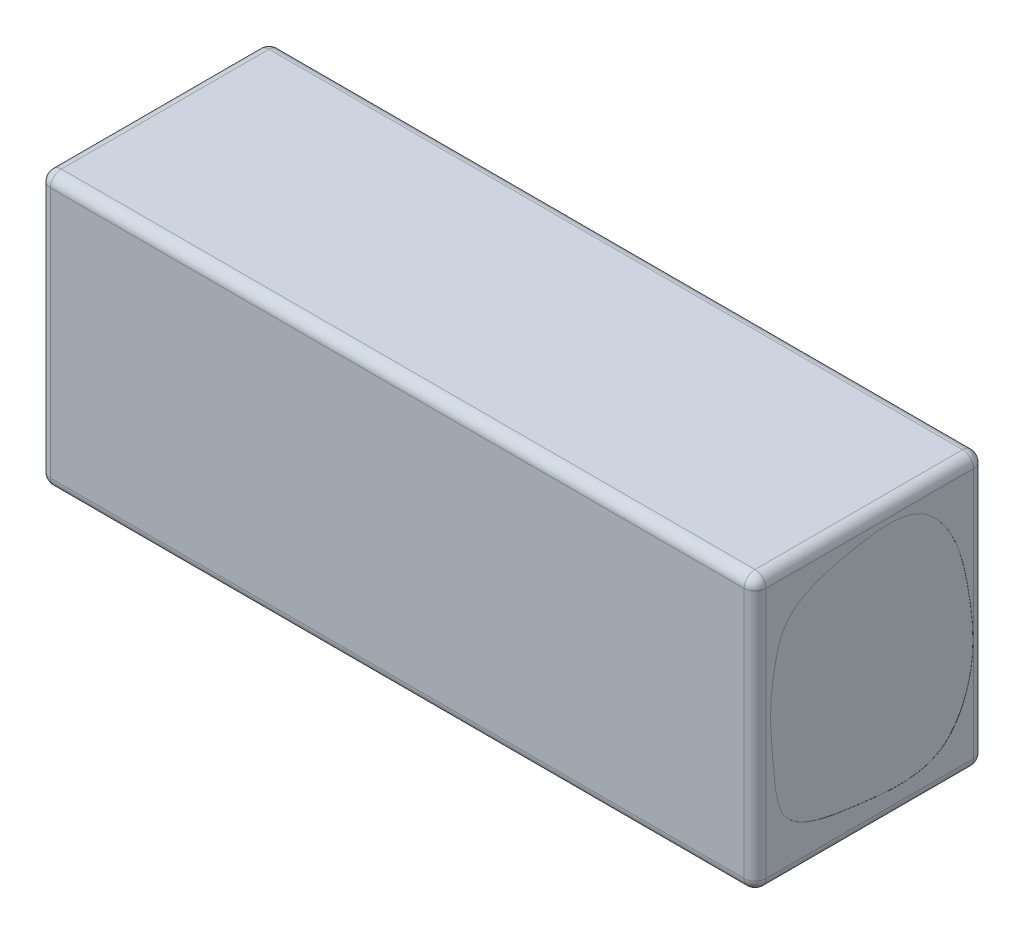
ISO-10303-21;
HEADER;
FILE_DESCRIPTION(('STEP AP214'),'2;1');
FILE_NAME('part.step','',(''),(''),'','','');
FILE_SCHEMA(('AUTOMOTIVE_DESIGN { 1 0 10303 214 1 1 1 1 }'));
ENDSEC;
DATA;
#1=APPLICATION_CONTEXT('core data for automotive mechanical design processes');
#2=APPLICATION_PROTOCOL_DEFINITION('international standard','automotive_design',2000,#1);
#3=PRODUCT_CONTEXT('',#1,'mechanical');
#4=PRODUCT('Part','Part','',(#3));
#5=PRODUCT_RELATED_PRODUCT_CATEGORY('part','',(#4));
#6=PRODUCT_DEFINITION_FORMATION('','',#4);
#7=PRODUCT_DEFINITION_CONTEXT('part definition',#1,'design');
#8=PRODUCT_DEFINITION('design','',#6,#7);
#9=PRODUCT_DEFINITION_SHAPE('','',#8);
#10=(LENGTH_UNIT() NAMED_UNIT(*) SI_UNIT(.MILLI.,.METRE.));
#11=(NAMED_UNIT(*) PLANE_ANGLE_UNIT() SI_UNIT($,.RADIAN.));
#12=(NAMED_UNIT(*) SI_UNIT($,.STERADIAN.) SOLID_ANGLE_UNIT());
#13=UNCERTAINTY_MEASURE_WITH_UNIT(LENGTH_MEASURE(1.E-05),#10,'distance_accuracy_value','');
#14=(GEOMETRIC_REPRESENTATION_CONTEXT(3) GLOBAL_UNCERTAINTY_ASSIGNED_CONTEXT((#13)) GLOBAL_UNIT_ASSIGNED_CONTEXT((#10,
#11,#12)) REPRESENTATION_CONTEXT('',''));
#15=CARTESIAN_POINT('',(0.,0.,0.));
#16=DIRECTION('',(0.,0.,1.));
#17=DIRECTION('',(1.,0.,0.));
#18=AXIS2_PLACEMENT_3D('',#15,#16,#17);
#19=CARTESIAN_POINT('',(65.5,50.,-21.));
#20=DIRECTION('',(-1.,0.,0.));
#21=DIRECTION('',(0.,0.,1.));
#22=AXIS2_PLACEMENT_3D('',#19,#20,#21);
#23=PLANE('',#22);
#24=DIRECTION('',(0.,0.,-1.));
#25=VECTOR('',#24,1.);
#26=CARTESIAN_POINT('',(65.5,48.,21.));
#27=LINE('',#26,#25);
#28=CARTESIAN_POINT('',(65.5,48.,-19.));
#29=VERTEX_POINT('',#28);
#30=CARTESIAN_POINT('',(65.5,48.,19.));
#31=VERTEX_POINT('',#30);
#32=EDGE_CURVE('E266',#29,#31,#27,.F.);
#33=ORIENTED_EDGE('',*,*,#32,.T.);
#34=DIRECTION('',(0.,-1.,0.));
#35=VECTOR('',#34,1.);
#36=CARTESIAN_POINT('',(65.5,50.,19.));
#37=LINE('',#36,#35);
#38=CARTESIAN_POINT('',(65.5,2.,19.));
#39=VERTEX_POINT('',#38);
#40=EDGE_CURVE('E11',#31,#39,#37,.T.);
#41=ORIENTED_EDGE('',*,*,#40,.T.);
#42=DIRECTION('',(0.,0.,-1.));
#43=VECTOR('',#42,1.);
#44=CARTESIAN_POINT('',(65.5,2.,-21.));
#45=LINE('',#44,#43);
#46=CARTESIAN_POINT('',(65.5,2.,-19.));
#47=VERTEX_POINT('',#46);
#48=EDGE_CURVE('E49',#39,#47,#45,.T.);
#49=ORIENTED_EDGE('',*,*,#48,.T.);
#50=DIRECTION('',(0.,-1.,0.));
#51=VECTOR('',#50,1.);
#52=CARTESIAN_POINT('',(65.5,50.,-19.));
#53=LINE('',#52,#51);
#54=EDGE_CURVE('E268',#47,#29,#53,.F.);
#55=ORIENTED_EDGE('',*,*,#54,.T.);
#56=EDGE_LOOP('',(#33,#41,#49,#55));
#57=FACE_BOUND('',#56,.T.);
#58=CARTESIAN_POINT('',(65.5,36.0062960021772,17.1121145566678));
#59=CARTESIAN_POINT('',(65.5,33.1858424415359,17.7934548720197));
#60=CARTESIAN_POINT('',(65.5,27.1956559210834,18.5188642546495));
#61=CARTESIAN_POINT('',(65.5,18.8029734796803,17.5432714824491));
#62=CARTESIAN_POINT('',(65.5,7.47670080643906,16.6669742288101));
#63=CARTESIAN_POINT('',(65.5,5.7999690782184,6.44101406092995));
#64=CARTESIAN_POINT('',(65.5,4.62237682686579,-3.03846388193815));
#65=CARTESIAN_POINT('',(65.5,3.8415159513343,-13.2611809845686));
#66=CARTESIAN_POINT('',(65.5,16.1684517078521,-19.7797162965153));
#67=CARTESIAN_POINT('',(65.5,27.9396396582075,-18.5050263082708));
#68=CARTESIAN_POINT('',(65.5,38.8581884667947,-16.1620227417595));
#69=CARTESIAN_POINT('',(65.5,48.1548398260885,-8.67976880806955));
#70=CARTESIAN_POINT('',(65.5,46.3624852692565,3.85963842153659));
#71=CARTESIAN_POINT('',(65.5,43.0888660648263,15.057082787652));
#72=CARTESIAN_POINT('',(65.5,37.4230165702435,16.7698756869761));
#73=CARTESIAN_POINT('',(65.5,36.0062960021772,17.1121145566678));
#74=B_SPLINE_CURVE_WITH_KNOTS('',3,(#58,#59,#60,#61,#62,#63,#64,#65,#66,#67,#68,#69,#70,#71,#72,
#73),.UNSPECIFIED.,.T.,.F.,(4,1,1,1,1,1,1,1,1,1,1,1,1,4),(0.,0.0655264461558585,
0.138836815268561,0.200734432776751,0.302156424209846,0.328629371683951,0.429788646280039,
0.502846282513567,0.615006546447287,0.699860715547892,0.760876953691549,0.868209931019146,
0.967085909402392,1.),.UNSPECIFIED.);
#75=CARTESIAN_POINT('',(65.5,36.0062960021772,17.1121145566678));
#76=VERTEX_POINT('',#75);
#77=EDGE_CURVE('E209',#76,#76,#74,.T.);
#78=ORIENTED_EDGE('',*,*,#77,.F.);
#79=EDGE_LOOP('',(#78));
#80=FACE_BOUND('',#79,.T.);
#81=ADVANCED_FACE('F40',(#57,#80),#23,.F.);
#82=CARTESIAN_POINT('',(-65.5,50.,-21.));
#83=DIRECTION('',(0.,0.,1.));
#84=DIRECTION('',(1.,0.,0.));
#85=AXIS2_PLACEMENT_3D('',#82,#83,#84);
#86=PLANE('',#85);
#87=DIRECTION('',(-1.,0.,0.));
#88=VECTOR('',#87,1.);
#89=CARTESIAN_POINT('',(-65.5,2.,-21.));
#90=LINE('',#89,#88);
#91=CARTESIAN_POINT('',(63.5,2.,-21.));
#92=VERTEX_POINT('',#91);
#93=CARTESIAN_POINT('',(-63.5,2.,-21.));
#94=VERTEX_POINT('',#93);
#95=EDGE_CURVE('E236',#92,#94,#90,.T.);
#96=ORIENTED_EDGE('',*,*,#95,.T.);
#97=DIRECTION('',(0.,-1.,0.));
#98=VECTOR('',#97,1.);
#99=CARTESIAN_POINT('',(-63.5,50.,-21.));
#100=LINE('',#99,#98);
#101=CARTESIAN_POINT('',(-63.5,48.,-21.));
#102=VERTEX_POINT('',#101);
#103=EDGE_CURVE('E238',#94,#102,#100,.F.);
#104=ORIENTED_EDGE('',*,*,#103,.T.);
#105=DIRECTION('',(-1.,0.,0.));
#106=VECTOR('',#105,1.);
#107=CARTESIAN_POINT('',(65.5,48.,-21.));
#108=LINE('',#107,#106);
#109=CARTESIAN_POINT('',(63.5,48.,-21.));
#110=VERTEX_POINT('',#109);
#111=EDGE_CURVE('E232',#102,#110,#108,.F.);
#112=ORIENTED_EDGE('',*,*,#111,.T.);
#113=DIRECTION('',(0.,-1.,0.));
#114=VECTOR('',#113,1.);
#115=CARTESIAN_POINT('',(63.5,50.,-21.));
#116=LINE('',#115,#114);
#117=EDGE_CURVE('E234',#110,#92,#116,.T.);
#118=ORIENTED_EDGE('',*,*,#117,.T.);
#119=EDGE_LOOP('',(#96,#104,#112,#118));
#120=FACE_BOUND('',#119,.T.);
#121=ADVANCED_FACE('F297',(#120),#86,.F.);
#122=CARTESIAN_POINT('',(-65.5,50.,-21.));
#123=DIRECTION('',(1.,0.,0.));
#124=DIRECTION('',(0.,0.,-1.));
#125=AXIS2_PLACEMENT_3D('',#122,#123,#124);
#126=PLANE('',#125);
#127=CARTESIAN_POINT('',(-65.5,42.5587834763661,8.97866157739457));
#128=CARTESIAN_POINT('',(-65.5,43.8675707907023,5.37594945374421));
#129=CARTESIAN_POINT('',(-65.5,41.7396562521845,-1.14983632543325));
#130=CARTESIAN_POINT('',(-65.5,44.554797073147,-9.76203087064664));
#131=CARTESIAN_POINT('',(-65.5,37.6722153826921,-16.5107817841148));
#132=CARTESIAN_POINT('',(-65.5,25.8616971193203,-13.6392715554001));
#133=CARTESIAN_POINT('',(-65.5,3.34634764429443,-23.1053905436355));
#134=CARTESIAN_POINT('',(-65.5,8.75557637014639,-6.65065098038429));
#135=CARTESIAN_POINT('',(-65.5,3.42196767539524,2.28549756826972));
#136=CARTESIAN_POINT('',(-65.5,8.17920037300755,9.79868266542826));
#137=CARTESIAN_POINT('',(-65.5,13.2239443400606,16.6332423186973));
#138=CARTESIAN_POINT('',(-65.5,19.8375980780647,14.8283893205622));
#139=CARTESIAN_POINT('',(-65.5,26.1536723415718,15.3352983576773));
#140=CARTESIAN_POINT('',(-65.5,31.4150364681281,13.3589295445617));
#141=CARTESIAN_POINT('',(-65.5,38.5245297048221,15.2358982718186));
#142=CARTESIAN_POINT('',(-65.5,41.8053956225414,11.0525199690935));
#143=CARTESIAN_POINT('',(-65.5,42.5587834763661,8.97866157739457));
#144=B_SPLINE_CURVE_WITH_KNOTS('',3,(#127,#128,#129,#130,#131,#132,#133,#134,#135,#136,#137,
#138,#139,#140,#141,#142,#143),.UNSPECIFIED.,.T.,.F.,(4,1,1,1,1,1,1,1,1,1,1,1,1,1,4),(0.,
0.0913203798077001,0.159387604604481,0.195313944729683,0.30049996701423,0.464636292585254,
0.542295543643821,0.617262825804197,0.702219658800756,0.735857869369271,0.81448894720544,
0.839285493394965,0.891602027228399,0.947432509315943,1.),.UNSPECIFIED.);
#145=CARTESIAN_POINT('',(-65.5,42.5587834763661,8.97866157739457));
#146=VERTEX_POINT('',#145);
#147=EDGE_CURVE('E606',#146,#146,#144,.T.);
#148=ORIENTED_EDGE('',*,*,#147,.F.);
#149=EDGE_LOOP('',(#148));
#150=FACE_BOUND('',#149,.T.);
#151=DIRECTION('',(0.,0.,1.));
#152=VECTOR('',#151,1.);
#153=CARTESIAN_POINT('',(-65.5,48.,-21.));
#154=LINE('',#153,#152);
#155=CARTESIAN_POINT('',(-65.5,48.,19.));
#156=VERTEX_POINT('',#155);
#157=CARTESIAN_POINT('',(-65.5,48.,-19.));
#158=VERTEX_POINT('',#157);
#159=EDGE_CURVE('E139',#156,#158,#154,.F.);
#160=ORIENTED_EDGE('',*,*,#159,.T.);
#161=DIRECTION('',(0.,-1.,0.));
#162=VECTOR('',#161,1.);
#163=CARTESIAN_POINT('',(-65.5,50.,-19.));
#164=LINE('',#163,#162);
#165=CARTESIAN_POINT('',(-65.5,2.,-19.));
#166=VERTEX_POINT('',#165);
#167=EDGE_CURVE('E135',#158,#166,#164,.T.);
#168=ORIENTED_EDGE('',*,*,#167,.T.);
#169=DIRECTION('',(0.,0.,1.));
#170=VECTOR('',#169,1.);
#171=CARTESIAN_POINT('',(-65.5,2.,-21.));
#172=LINE('',#171,#170);
#173=CARTESIAN_POINT('',(-65.5,2.,19.));
#174=VERTEX_POINT('',#173);
#175=EDGE_CURVE('E129',#166,#174,#172,.T.);
#176=ORIENTED_EDGE('',*,*,#175,.T.);
#177=DIRECTION('',(0.,-1.,0.));
#178=VECTOR('',#177,1.);
#179=CARTESIAN_POINT('',(-65.5,50.,19.));
#180=LINE('',#179,#178);
#181=EDGE_CURVE('E132',#174,#156,#180,.F.);
#182=ORIENTED_EDGE('',*,*,#181,.T.);
#183=EDGE_LOOP('',(#160,#168,#176,#182));
#184=FACE_BOUND('',#183,.T.);
#185=ADVANCED_FACE('F131',(#150,#184),#126,.F.);
#186=CARTESIAN_POINT('',(-65.5,50.,21.));
#187=DIRECTION('',(0.,0.,-1.));
#188=DIRECTION('',(-1.,0.,0.));
#189=AXIS2_PLACEMENT_3D('',#186,#187,#188);
#190=PLANE('',#189);
#191=DIRECTION('',(1.,0.,0.));
#192=VECTOR('',#191,1.);
#193=CARTESIAN_POINT('',(-65.5,48.,21.));
#194=LINE('',#193,#192);
#195=CARTESIAN_POINT('',(63.5,48.,21.));
#196=VERTEX_POINT('',#195);
#197=CARTESIAN_POINT('',(-63.5,48.,21.));
#198=VERTEX_POINT('',#197);
#199=EDGE_CURVE('E257',#196,#198,#194,.F.);
#200=ORIENTED_EDGE('',*,*,#199,.T.);
#201=DIRECTION('',(0.,-1.,0.));
#202=VECTOR('',#201,1.);
#203=CARTESIAN_POINT('',(-63.5,50.,21.));
#204=LINE('',#203,#202);
#205=CARTESIAN_POINT('',(-63.5,2.,21.));
#206=VERTEX_POINT('',#205);
#207=EDGE_CURVE('E263',#198,#206,#204,.T.);
#208=ORIENTED_EDGE('',*,*,#207,.T.);
#209=DIRECTION('',(1.,0.,0.));
#210=VECTOR('',#209,1.);
#211=CARTESIAN_POINT('',(-65.5,2.,21.));
#212=LINE('',#211,#210);
#213=CARTESIAN_POINT('',(63.5,2.,21.));
#214=VERTEX_POINT('',#213);
#215=EDGE_CURVE('E261',#206,#214,#212,.T.);
#216=ORIENTED_EDGE('',*,*,#215,.T.);
#217=DIRECTION('',(0.,-1.,0.));
#218=VECTOR('',#217,1.);
#219=CARTESIAN_POINT('',(63.5,50.,21.));
#220=LINE('',#219,#218);
#221=EDGE_CURVE('E259',#214,#196,#220,.F.);
#222=ORIENTED_EDGE('',*,*,#221,.T.);
#223=EDGE_LOOP('',(#200,#208,#216,#222));
#224=FACE_BOUND('',#223,.T.);
#225=ADVANCED_FACE('F317',(#224),#190,.F.);
#226=CARTESIAN_POINT('',(0.,50.,0.));
#227=DIRECTION('',(0.,1.,0.));
#228=DIRECTION('',(0.,0.,1.));
#229=AXIS2_PLACEMENT_3D('',#226,#227,#228);
#230=PLANE('',#229);
#231=DIRECTION('',(0.,0.,-1.));
#232=VECTOR('',#231,1.);
#233=CARTESIAN_POINT('',(63.5,50.,-21.));
#234=LINE('',#233,#232);
#235=CARTESIAN_POINT('',(63.5,50.,19.));
#236=VERTEX_POINT('',#235);
#237=CARTESIAN_POINT('',(63.5,50.,-19.));
#238=VERTEX_POINT('',#237);
#239=EDGE_CURVE('E250',#236,#238,#234,.T.);
#240=ORIENTED_EDGE('',*,*,#239,.T.);
#241=DIRECTION('',(-1.,0.,0.));
#242=VECTOR('',#241,1.);
#243=CARTESIAN_POINT('',(-65.5,50.,-19.));
#244=LINE('',#243,#242);
#245=CARTESIAN_POINT('',(-63.5,50.,-19.));
#246=VERTEX_POINT('',#245);
#247=EDGE_CURVE('E255',#238,#246,#244,.T.);
#248=ORIENTED_EDGE('',*,*,#247,.T.);
#249=DIRECTION('',(0.,0.,1.));
#250=VECTOR('',#249,1.);
#251=CARTESIAN_POINT('',(-63.5,50.,21.));
#252=LINE('',#251,#250);
#253=CARTESIAN_POINT('',(-63.5,50.,19.));
#254=VERTEX_POINT('',#253);
#255=EDGE_CURVE('E252',#246,#254,#252,.T.);
#256=ORIENTED_EDGE('',*,*,#255,.T.);
#257=DIRECTION('',(1.,0.,0.));
#258=VECTOR('',#257,1.);
#259=CARTESIAN_POINT('',(65.5,50.,19.));
#260=LINE('',#259,#258);
#261=EDGE_CURVE('E248',#254,#236,#260,.T.);
#262=ORIENTED_EDGE('',*,*,#261,.T.);
#263=EDGE_LOOP('',(#240,#248,#256,#262));
#264=FACE_BOUND('',#263,.T.);
#265=ADVANCED_FACE('F330',(#264),#230,.T.);
#266=CARTESIAN_POINT('',(0.,0.,0.));
#267=DIRECTION('',(0.,1.,0.));
#268=DIRECTION('',(0.,0.,1.));
#269=AXIS2_PLACEMENT_3D('',#266,#267,#268);
#270=PLANE('',#269);
#271=DIRECTION('',(1.,0.,0.));
#272=VECTOR('',#271,1.);
#273=CARTESIAN_POINT('',(0.,0.,19.));
#274=LINE('',#273,#272);
#275=CARTESIAN_POINT('',(63.5,0.,19.));
#276=VERTEX_POINT('',#275);
#277=CARTESIAN_POINT('',(-63.5,0.,19.));
#278=VERTEX_POINT('',#277);
#279=EDGE_CURVE('E243',#276,#278,#274,.F.);
#280=ORIENTED_EDGE('',*,*,#279,.T.);
#281=DIRECTION('',(0.,0.,1.));
#282=VECTOR('',#281,1.);
#283=CARTESIAN_POINT('',(-63.5,0.,0.));
#284=LINE('',#283,#282);
#285=CARTESIAN_POINT('',(-63.5,0.,-19.));
#286=VERTEX_POINT('',#285);
#287=EDGE_CURVE('E163',#278,#286,#284,.F.);
#288=ORIENTED_EDGE('',*,*,#287,.T.);
#289=DIRECTION('',(-1.,0.,0.));
#290=VECTOR('',#289,1.);
#291=CARTESIAN_POINT('',(0.,0.,-19.));
#292=LINE('',#291,#290);
#293=CARTESIAN_POINT('',(63.5,0.,-19.));
#294=VERTEX_POINT('',#293);
#295=EDGE_CURVE('E245',#286,#294,#292,.F.);
#296=ORIENTED_EDGE('',*,*,#295,.T.);
#297=DIRECTION('',(0.,0.,-1.));
#298=VECTOR('',#297,1.);
#299=CARTESIAN_POINT('',(63.5,0.,0.));
#300=LINE('',#299,#298);
#301=EDGE_CURVE('E241',#294,#276,#300,.F.);
#302=ORIENTED_EDGE('',*,*,#301,.T.);
#303=EDGE_LOOP('',(#280,#288,#296,#302));
#304=FACE_BOUND('',#303,.T.);
#305=ADVANCED_FACE('F311',(#304),#270,.F.);
#306=CARTESIAN_POINT('',(65.48,36.0062960021772,17.1121145566678));
#307=CARTESIAN_POINT('',(65.48,33.1858424415359,17.7934548720197));
#308=CARTESIAN_POINT('',(65.48,27.1956559210834,18.5188642546495));
#309=CARTESIAN_POINT('',(65.48,18.8029734796803,17.5432714824491));
#310=CARTESIAN_POINT('',(65.48,7.47670080643906,16.6669742288101));
#311=CARTESIAN_POINT('',(65.48,5.7999690782184,6.44101406092995));
#312=CARTESIAN_POINT('',(65.48,4.62237682686579,-3.03846388193815));
#313=CARTESIAN_POINT('',(65.48,3.8415159513343,-13.2611809845686));
#314=CARTESIAN_POINT('',(65.48,16.1684517078521,-19.7797162965153));
#315=CARTESIAN_POINT('',(65.48,27.9396396582075,-18.5050263082708));
#316=CARTESIAN_POINT('',(65.48,38.8581884667947,-16.1620227417595));
#317=CARTESIAN_POINT('',(65.48,48.1548398260885,-8.67976880806955));
#318=CARTESIAN_POINT('',(65.48,46.3624852692565,3.85963842153659));
#319=CARTESIAN_POINT('',(65.48,43.0888660648263,15.057082787652));
#320=CARTESIAN_POINT('',(65.48,37.4230165702435,16.7698756869761));
#321=CARTESIAN_POINT('',(65.48,36.0062960021772,17.1121145566678));
#322=B_SPLINE_CURVE_WITH_KNOTS('',3,(#306,#307,#308,#309,#310,#311,#312,#313,#314,#315,#316,
#317,#318,#319,#320,#321),.UNSPECIFIED.,.T.,.F.,(4,1,1,1,1,1,1,1,1,1,1,1,1,4),(0.,
0.0655264461558585,0.138836815268561,0.200734432776751,0.302156424209846,0.328629371683951,
0.429788646280039,0.502846282513567,0.615006546447287,0.699860715547892,0.760876953691549,
0.868209931019146,0.967085909402392,1.),.UNSPECIFIED.);
#323=DIRECTION('',(1.,0.,0.));
#324=VECTOR('',#323,1.);
#325=SURFACE_OF_LINEAR_EXTRUSION('',#322,#324);
#326=CARTESIAN_POINT('',(65.48,36.0062960021772,17.1121145566678));
#327=VERTEX_POINT('',#326);
#328=EDGE_CURVE('E151',#327,#327,#322,.T.);
#329=ORIENTED_EDGE('',*,*,#328,.F.);
#330=EDGE_LOOP('',(#329));
#331=FACE_BOUND('',#330,.T.);
#332=ORIENTED_EDGE('',*,*,#77,.T.);
#333=EDGE_LOOP('',(#332));
#334=FACE_BOUND('',#333,.T.);
#335=ADVANCED_FACE('F541',(#331,#334),#325,.F.);
#336=CARTESIAN_POINT('',(65.48,14.1316743413128,-17.9923043886526));
#337=DIRECTION('',(1.,0.,0.));
#338=DIRECTION('',(0.,0.,-1.));
#339=AXIS2_PLACEMENT_3D('',#336,#337,#338);
#340=PLANE('',#339);
#341=ORIENTED_EDGE('',*,*,#328,.T.);
#342=EDGE_LOOP('',(#341));
#343=FACE_BOUND('',#342,.T.);
#344=ADVANCED_FACE('F532',(#343),#340,.T.);
#345=CARTESIAN_POINT('',(63.5,50.,19.));
#346=DIRECTION('',(0.,-1.,0.));
#347=DIRECTION('',(0.,0.,-1.));
#348=AXIS2_PLACEMENT_3D('',#345,#346,#347);
#349=CYLINDRICAL_SURFACE('',#348,2.);
#350=CARTESIAN_POINT('',(63.5,48.,19.));
#351=DIRECTION('',(0.,1.,0.));
#352=DIRECTION('',(0.,0.,1.));
#353=AXIS2_PLACEMENT_3D('',#350,#351,#352);
#354=CIRCLE('',#353,2.);
#355=EDGE_CURVE('E44',#196,#31,#354,.T.);
#356=ORIENTED_EDGE('',*,*,#355,.F.);
#357=ORIENTED_EDGE('',*,*,#221,.F.);
#358=CARTESIAN_POINT('',(63.5,2.,19.));
#359=DIRECTION('',(0.,-1.,0.));
#360=DIRECTION('',(0.,0.,-1.));
#361=AXIS2_PLACEMENT_3D('',#358,#359,#360);
#362=CIRCLE('',#361,2.);
#363=EDGE_CURVE('E203',#39,#214,#362,.T.);
#364=ORIENTED_EDGE('',*,*,#363,.F.);
#365=ORIENTED_EDGE('',*,*,#40,.F.);
#366=EDGE_LOOP('',(#356,#357,#364,#365));
#367=FACE_BOUND('',#366,.T.);
#368=ADVANCED_FACE('F42',(#367),#349,.T.);
#369=CARTESIAN_POINT('',(63.5,48.,19.));
#370=DIRECTION('',(0.,0.,1.));
#371=DIRECTION('',(1.,0.,0.));
#372=AXIS2_PLACEMENT_3D('',#369,#370,#371);
#373=SPHERICAL_SURFACE('',#372,2.);
#374=CARTESIAN_POINT('',(63.5,48.,19.));
#375=DIRECTION('',(1.,0.,0.));
#376=DIRECTION('',(0.,0.,-1.));
#377=AXIS2_PLACEMENT_3D('',#374,#375,#376);
#378=CIRCLE('',#377,2.);
#379=EDGE_CURVE('E198',#196,#236,#378,.F.);
#380=ORIENTED_EDGE('',*,*,#379,.F.);
#381=ORIENTED_EDGE('',*,*,#355,.T.);
#382=CARTESIAN_POINT('',(63.5,48.,19.));
#383=DIRECTION('',(0.,0.,1.));
#384=DIRECTION('',(1.,0.,0.));
#385=AXIS2_PLACEMENT_3D('',#382,#383,#384);
#386=CIRCLE('',#385,2.);
#387=EDGE_CURVE('E201',#236,#31,#386,.F.);
#388=ORIENTED_EDGE('',*,*,#387,.F.);
#389=EDGE_LOOP('',(#380,#381,#388));
#390=FACE_BOUND('',#389,.T.);
#391=ADVANCED_FACE('F347',(#390),#373,.T.);
#392=CARTESIAN_POINT('',(63.5,2.,19.));
#393=DIRECTION('',(0.,0.,1.));
#394=DIRECTION('',(1.,0.,0.));
#395=AXIS2_PLACEMENT_3D('',#392,#393,#394);
#396=SPHERICAL_SURFACE('',#395,2.);
#397=CARTESIAN_POINT('',(63.5,2.,19.));
#398=DIRECTION('',(0.,0.,1.));
#399=DIRECTION('',(1.,0.,0.));
#400=AXIS2_PLACEMENT_3D('',#397,#398,#399);
#401=CIRCLE('',#400,2.);
#402=EDGE_CURVE('E193',#39,#276,#401,.F.);
#403=ORIENTED_EDGE('',*,*,#402,.F.);
#404=ORIENTED_EDGE('',*,*,#363,.T.);
#405=CARTESIAN_POINT('',(63.5,2.,19.));
#406=DIRECTION('',(1.,0.,0.));
#407=DIRECTION('',(0.,0.,-1.));
#408=AXIS2_PLACEMENT_3D('',#405,#406,#407);
#409=CIRCLE('',#408,2.);
#410=EDGE_CURVE('E195',#276,#214,#409,.F.);
#411=ORIENTED_EDGE('',*,*,#410,.F.);
#412=EDGE_LOOP('',(#403,#404,#411));
#413=FACE_BOUND('',#412,.T.);
#414=ADVANCED_FACE('F345',(#413),#396,.T.);
#415=CARTESIAN_POINT('',(63.5,48.,0.));
#416=DIRECTION('',(0.,0.,1.));
#417=DIRECTION('',(1.,0.,0.));
#418=AXIS2_PLACEMENT_3D('',#415,#416,#417);
#419=CYLINDRICAL_SURFACE('',#418,2.);
#420=ORIENTED_EDGE('',*,*,#387,.T.);
#421=ORIENTED_EDGE('',*,*,#32,.F.);
#422=CARTESIAN_POINT('',(63.5,48.,-19.));
#423=DIRECTION('',(0.,0.,-1.));
#424=DIRECTION('',(-1.,0.,0.));
#425=AXIS2_PLACEMENT_3D('',#422,#423,#424);
#426=CIRCLE('',#425,2.);
#427=EDGE_CURVE('E187',#238,#29,#426,.T.);
#428=ORIENTED_EDGE('',*,*,#427,.F.);
#429=ORIENTED_EDGE('',*,*,#239,.F.);
#430=EDGE_LOOP('',(#420,#421,#428,#429));
#431=FACE_BOUND('',#430,.T.);
#432=ADVANCED_FACE('F335',(#431),#419,.T.);
#433=CARTESIAN_POINT('',(0.,48.,19.));
#434=DIRECTION('',(-1.,0.,0.));
#435=DIRECTION('',(0.,0.,1.));
#436=AXIS2_PLACEMENT_3D('',#433,#434,#435);
#437=CYLINDRICAL_SURFACE('',#436,2.);
#438=ORIENTED_EDGE('',*,*,#379,.T.);
#439=ORIENTED_EDGE('',*,*,#261,.F.);
#440=CARTESIAN_POINT('',(-63.5,48.,19.));
#441=DIRECTION('',(-1.,0.,0.));
#442=DIRECTION('',(0.,0.,1.));
#443=AXIS2_PLACEMENT_3D('',#440,#441,#442);
#444=CIRCLE('',#443,2.);
#445=EDGE_CURVE('E184',#198,#254,#444,.T.);
#446=ORIENTED_EDGE('',*,*,#445,.F.);
#447=ORIENTED_EDGE('',*,*,#199,.F.);
#448=EDGE_LOOP('',(#438,#439,#446,#447));
#449=FACE_BOUND('',#448,.T.);
#450=ADVANCED_FACE('F322',(#449),#437,.T.);
#451=CARTESIAN_POINT('',(-63.5,50.,19.));
#452=DIRECTION('',(0.,-1.,0.));
#453=DIRECTION('',(0.,0.,-1.));
#454=AXIS2_PLACEMENT_3D('',#451,#452,#453);
#455=CYLINDRICAL_SURFACE('',#454,2.);
#456=CARTESIAN_POINT('',(-63.5,2.,19.));
#457=DIRECTION('',(0.,-1.,0.));
#458=DIRECTION('',(0.,0.,-1.));
#459=AXIS2_PLACEMENT_3D('',#456,#457,#458);
#460=CIRCLE('',#459,2.);
#461=EDGE_CURVE('E146',#206,#174,#460,.T.);
#462=ORIENTED_EDGE('',*,*,#461,.F.);
#463=ORIENTED_EDGE('',*,*,#207,.F.);
#464=CARTESIAN_POINT('',(-63.5,48.,19.));
#465=DIRECTION('',(0.,1.,0.));
#466=DIRECTION('',(0.,0.,1.));
#467=AXIS2_PLACEMENT_3D('',#464,#465,#466);
#468=CIRCLE('',#467,2.);
#469=EDGE_CURVE('E149',#156,#198,#468,.T.);
#470=ORIENTED_EDGE('',*,*,#469,.F.);
#471=ORIENTED_EDGE('',*,*,#181,.F.);
#472=EDGE_LOOP('',(#462,#463,#470,#471));
#473=FACE_BOUND('',#472,.T.);
#474=ADVANCED_FACE('F144',(#473),#455,.T.);
#475=CARTESIAN_POINT('',(-65.5,2.,19.));
#476=DIRECTION('',(1.,0.,0.));
#477=DIRECTION('',(0.,0.,-1.));
#478=AXIS2_PLACEMENT_3D('',#475,#476,#477);
#479=CYLINDRICAL_SURFACE('',#478,2.);
#480=ORIENTED_EDGE('',*,*,#410,.T.);
#481=ORIENTED_EDGE('',*,*,#215,.F.);
#482=CARTESIAN_POINT('',(-63.5,2.,19.));
#483=DIRECTION('',(-1.,0.,0.));
#484=DIRECTION('',(0.,0.,1.));
#485=AXIS2_PLACEMENT_3D('',#482,#483,#484);
#486=CIRCLE('',#485,2.);
#487=EDGE_CURVE('E159',#278,#206,#486,.T.);
#488=ORIENTED_EDGE('',*,*,#487,.F.);
#489=ORIENTED_EDGE('',*,*,#279,.F.);
#490=EDGE_LOOP('',(#480,#481,#488,#489));
#491=FACE_BOUND('',#490,.T.);
#492=ADVANCED_FACE('F314',(#491),#479,.T.);
#493=CARTESIAN_POINT('',(63.5,2.,-21.));
#494=DIRECTION('',(0.,0.,-1.));
#495=DIRECTION('',(-1.,0.,0.));
#496=AXIS2_PLACEMENT_3D('',#493,#494,#495);
#497=CYLINDRICAL_SURFACE('',#496,2.);
#498=ORIENTED_EDGE('',*,*,#402,.T.);
#499=ORIENTED_EDGE('',*,*,#301,.F.);
#500=CARTESIAN_POINT('',(63.5,2.,-19.));
#501=DIRECTION('',(0.,0.,-1.));
#502=DIRECTION('',(-1.,0.,0.));
#503=AXIS2_PLACEMENT_3D('',#500,#501,#502);
#504=CIRCLE('',#503,2.);
#505=EDGE_CURVE('E179',#47,#294,#504,.T.);
#506=ORIENTED_EDGE('',*,*,#505,.F.);
#507=ORIENTED_EDGE('',*,*,#48,.F.);
#508=EDGE_LOOP('',(#498,#499,#506,#507));
#509=FACE_BOUND('',#508,.T.);
#510=ADVANCED_FACE('F344',(#509),#497,.T.);
#511=CARTESIAN_POINT('',(63.5,50.,-19.));
#512=DIRECTION('',(0.,-1.,0.));
#513=DIRECTION('',(0.,0.,-1.));
#514=AXIS2_PLACEMENT_3D('',#511,#512,#513);
#515=CYLINDRICAL_SURFACE('',#514,2.);
#516=CARTESIAN_POINT('',(63.5,48.,-19.));
#517=DIRECTION('',(0.,1.,0.));
#518=DIRECTION('',(0.,0.,1.));
#519=AXIS2_PLACEMENT_3D('',#516,#517,#518);
#520=CIRCLE('',#519,2.);
#521=EDGE_CURVE('E190',#29,#110,#520,.T.);
#522=ORIENTED_EDGE('',*,*,#521,.F.);
#523=ORIENTED_EDGE('',*,*,#54,.F.);
#524=CARTESIAN_POINT('',(63.5,2.,-19.));
#525=DIRECTION('',(0.,-1.,0.));
#526=DIRECTION('',(0.,0.,-1.));
#527=AXIS2_PLACEMENT_3D('',#524,#525,#526);
#528=CIRCLE('',#527,2.);
#529=EDGE_CURVE('E176',#92,#47,#528,.T.);
#530=ORIENTED_EDGE('',*,*,#529,.F.);
#531=ORIENTED_EDGE('',*,*,#117,.F.);
#532=EDGE_LOOP('',(#522,#523,#530,#531));
#533=FACE_BOUND('',#532,.T.);
#534=ADVANCED_FACE('F340',(#533),#515,.T.);
#535=CARTESIAN_POINT('',(63.5,48.,-19.));
#536=DIRECTION('',(0.,0.,1.));
#537=DIRECTION('',(1.,0.,0.));
#538=AXIS2_PLACEMENT_3D('',#535,#536,#537);
#539=SPHERICAL_SURFACE('',#538,2.);
#540=ORIENTED_EDGE('',*,*,#427,.T.);
#541=ORIENTED_EDGE('',*,*,#521,.T.);
#542=CARTESIAN_POINT('',(63.5,48.,-19.));
#543=DIRECTION('',(1.,0.,0.));
#544=DIRECTION('',(0.,1.,0.));
#545=AXIS2_PLACEMENT_3D('',#542,#543,#544);
#546=CIRCLE('',#545,2.);
#547=EDGE_CURVE('E167',#238,#110,#546,.F.);
#548=ORIENTED_EDGE('',*,*,#547,.F.);
#549=EDGE_LOOP('',(#540,#541,#548));
#550=FACE_BOUND('',#549,.T.);
#551=ADVANCED_FACE('F338',(#550),#539,.T.);
#552=CARTESIAN_POINT('',(-63.5,48.,19.));
#553=DIRECTION('',(0.,0.,1.));
#554=DIRECTION('',(1.,0.,0.));
#555=AXIS2_PLACEMENT_3D('',#552,#553,#554);
#556=SPHERICAL_SURFACE('',#555,2.);
#557=ORIENTED_EDGE('',*,*,#469,.T.);
#558=ORIENTED_EDGE('',*,*,#445,.T.);
#559=CARTESIAN_POINT('',(-63.5,48.,19.));
#560=DIRECTION('',(0.,0.,1.));
#561=DIRECTION('',(1.,0.,0.));
#562=AXIS2_PLACEMENT_3D('',#559,#560,#561);
#563=CIRCLE('',#562,2.);
#564=EDGE_CURVE('E164',#156,#254,#563,.F.);
#565=ORIENTED_EDGE('',*,*,#564,.F.);
#566=EDGE_LOOP('',(#557,#558,#565));
#567=FACE_BOUND('',#566,.T.);
#568=ADVANCED_FACE('F324',(#567),#556,.T.);
#569=CARTESIAN_POINT('',(-63.5,2.,19.));
#570=DIRECTION('',(0.,0.,1.));
#571=DIRECTION('',(1.,0.,0.));
#572=AXIS2_PLACEMENT_3D('',#569,#570,#571);
#573=SPHERICAL_SURFACE('',#572,2.);
#574=ORIENTED_EDGE('',*,*,#487,.T.);
#575=ORIENTED_EDGE('',*,*,#461,.T.);
#576=CARTESIAN_POINT('',(-63.5,2.,19.));
#577=DIRECTION('',(0.,0.,1.));
#578=DIRECTION('',(1.,0.,0.));
#579=AXIS2_PLACEMENT_3D('',#576,#577,#578);
#580=CIRCLE('',#579,2.);
#581=EDGE_CURVE('E156',#278,#174,#580,.F.);
#582=ORIENTED_EDGE('',*,*,#581,.F.);
#583=EDGE_LOOP('',(#574,#575,#582));
#584=FACE_BOUND('',#583,.T.);
#585=ADVANCED_FACE('F155',(#584),#573,.T.);
#586=CARTESIAN_POINT('',(63.5,2.,-19.));
#587=DIRECTION('',(0.,0.,1.));
#588=DIRECTION('',(1.,0.,0.));
#589=AXIS2_PLACEMENT_3D('',#586,#587,#588);
#590=SPHERICAL_SURFACE('',#589,2.);
#591=ORIENTED_EDGE('',*,*,#529,.T.);
#592=ORIENTED_EDGE('',*,*,#505,.T.);
#593=CARTESIAN_POINT('',(63.5,2.,-19.));
#594=DIRECTION('',(1.,0.,0.));
#595=DIRECTION('',(0.,0.,-1.));
#596=AXIS2_PLACEMENT_3D('',#593,#594,#595);
#597=CIRCLE('',#596,2.);
#598=EDGE_CURVE('E165',#92,#294,#597,.F.);
#599=ORIENTED_EDGE('',*,*,#598,.F.);
#600=EDGE_LOOP('',(#591,#592,#599));
#601=FACE_BOUND('',#600,.T.);
#602=ADVANCED_FACE('F343',(#601),#590,.T.);
#603=CARTESIAN_POINT('',(0.,48.,-19.));
#604=DIRECTION('',(1.,0.,0.));
#605=DIRECTION('',(0.,0.,-1.));
#606=AXIS2_PLACEMENT_3D('',#603,#604,#605);
#607=CYLINDRICAL_SURFACE('',#606,2.);
#608=ORIENTED_EDGE('',*,*,#547,.T.);
#609=ORIENTED_EDGE('',*,*,#111,.F.);
#610=CARTESIAN_POINT('',(-63.5,48.,-19.));
#611=DIRECTION('',(-1.,0.,0.));
#612=DIRECTION('',(0.,0.,1.));
#613=AXIS2_PLACEMENT_3D('',#610,#611,#612);
#614=CIRCLE('',#613,2.);
#615=EDGE_CURVE('E170',#246,#102,#614,.T.);
#616=ORIENTED_EDGE('',*,*,#615,.F.);
#617=ORIENTED_EDGE('',*,*,#247,.F.);
#618=EDGE_LOOP('',(#608,#609,#616,#617));
#619=FACE_BOUND('',#618,.T.);
#620=ADVANCED_FACE('F292',(#619),#607,.T.);
#621=CARTESIAN_POINT('',(-63.5,48.,0.));
#622=DIRECTION('',(0.,0.,-1.));
#623=DIRECTION('',(-1.,0.,0.));
#624=AXIS2_PLACEMENT_3D('',#621,#622,#623);
#625=CYLINDRICAL_SURFACE('',#624,2.);
#626=ORIENTED_EDGE('',*,*,#564,.T.);
#627=ORIENTED_EDGE('',*,*,#255,.F.);
#628=CARTESIAN_POINT('',(-63.5,48.,-19.));
#629=DIRECTION('',(0.,0.,-1.));
#630=DIRECTION('',(-1.,0.,0.));
#631=AXIS2_PLACEMENT_3D('',#628,#629,#630);
#632=CIRCLE('',#631,2.);
#633=EDGE_CURVE('E281',#158,#246,#632,.T.);
#634=ORIENTED_EDGE('',*,*,#633,.F.);
#635=ORIENTED_EDGE('',*,*,#159,.F.);
#636=EDGE_LOOP('',(#626,#627,#634,#635));
#637=FACE_BOUND('',#636,.T.);
#638=ADVANCED_FACE('F328',(#637),#625,.T.);
#639=CARTESIAN_POINT('',(-63.5,2.,-21.));
#640=DIRECTION('',(0.,0.,1.));
#641=DIRECTION('',(1.,0.,0.));
#642=AXIS2_PLACEMENT_3D('',#639,#640,#641);
#643=CYLINDRICAL_SURFACE('',#642,2.);
#644=ORIENTED_EDGE('',*,*,#581,.T.);
#645=ORIENTED_EDGE('',*,*,#175,.F.);
#646=CARTESIAN_POINT('',(-63.5,2.,-19.));
#647=DIRECTION('',(0.,0.,-1.));
#648=DIRECTION('',(-1.,0.,0.));
#649=AXIS2_PLACEMENT_3D('',#646,#647,#648);
#650=CIRCLE('',#649,2.);
#651=EDGE_CURVE('E278',#286,#166,#650,.T.);
#652=ORIENTED_EDGE('',*,*,#651,.F.);
#653=ORIENTED_EDGE('',*,*,#287,.F.);
#654=EDGE_LOOP('',(#644,#645,#652,#653));
#655=FACE_BOUND('',#654,.T.);
#656=ADVANCED_FACE('F161',(#655),#643,.T.);
#657=CARTESIAN_POINT('',(-65.5,2.,-19.));
#658=DIRECTION('',(-1.,0.,0.));
#659=DIRECTION('',(0.,0.,1.));
#660=AXIS2_PLACEMENT_3D('',#657,#658,#659);
#661=CYLINDRICAL_SURFACE('',#660,2.);
#662=ORIENTED_EDGE('',*,*,#598,.T.);
#663=ORIENTED_EDGE('',*,*,#295,.F.);
#664=CARTESIAN_POINT('',(-63.5,2.,-19.));
#665=DIRECTION('',(-1.,0.,0.));
#666=DIRECTION('',(0.,0.,1.));
#667=AXIS2_PLACEMENT_3D('',#664,#665,#666);
#668=CIRCLE('',#667,2.);
#669=EDGE_CURVE('E276',#94,#286,#668,.T.);
#670=ORIENTED_EDGE('',*,*,#669,.F.);
#671=ORIENTED_EDGE('',*,*,#95,.F.);
#672=EDGE_LOOP('',(#662,#663,#670,#671));
#673=FACE_BOUND('',#672,.T.);
#674=ADVANCED_FACE('F307',(#673),#661,.T.);
#675=CARTESIAN_POINT('',(-63.5,48.,-19.));
#676=DIRECTION('',(0.,0.,1.));
#677=DIRECTION('',(1.,0.,0.));
#678=AXIS2_PLACEMENT_3D('',#675,#676,#677);
#679=SPHERICAL_SURFACE('',#678,2.);
#680=ORIENTED_EDGE('',*,*,#633,.T.);
#681=ORIENTED_EDGE('',*,*,#615,.T.);
#682=CARTESIAN_POINT('',(-63.5,48.,-19.));
#683=DIRECTION('',(0.,1.,0.));
#684=DIRECTION('',(0.,0.,1.));
#685=AXIS2_PLACEMENT_3D('',#682,#683,#684);
#686=CIRCLE('',#685,2.);
#687=EDGE_CURVE('E273',#158,#102,#686,.F.);
#688=ORIENTED_EDGE('',*,*,#687,.F.);
#689=EDGE_LOOP('',(#680,#681,#688));
#690=FACE_BOUND('',#689,.T.);
#691=ADVANCED_FACE('F288',(#690),#679,.T.);
#692=CARTESIAN_POINT('',(-63.5,2.,-19.));
#693=DIRECTION('',(0.,0.,1.));
#694=DIRECTION('',(1.,0.,0.));
#695=AXIS2_PLACEMENT_3D('',#692,#693,#694);
#696=SPHERICAL_SURFACE('',#695,2.);
#697=ORIENTED_EDGE('',*,*,#669,.T.);
#698=ORIENTED_EDGE('',*,*,#651,.T.);
#699=CARTESIAN_POINT('',(-63.5,2.,-19.));
#700=DIRECTION('',(0.,-1.,0.));
#701=DIRECTION('',(0.,0.,-1.));
#702=AXIS2_PLACEMENT_3D('',#699,#700,#701);
#703=CIRCLE('',#702,2.);
#704=EDGE_CURVE('E271',#94,#166,#703,.F.);
#705=ORIENTED_EDGE('',*,*,#704,.F.);
#706=EDGE_LOOP('',(#697,#698,#705));
#707=FACE_BOUND('',#706,.T.);
#708=ADVANCED_FACE('F304',(#707),#696,.T.);
#709=CARTESIAN_POINT('',(-63.5,50.,-19.));
#710=DIRECTION('',(0.,-1.,0.));
#711=DIRECTION('',(0.,0.,-1.));
#712=AXIS2_PLACEMENT_3D('',#709,#710,#711);
#713=CYLINDRICAL_SURFACE('',#712,2.);
#714=ORIENTED_EDGE('',*,*,#687,.T.);
#715=ORIENTED_EDGE('',*,*,#103,.F.);
#716=ORIENTED_EDGE('',*,*,#704,.T.);
#717=ORIENTED_EDGE('',*,*,#167,.F.);
#718=EDGE_LOOP('',(#714,#715,#716,#717));
#719=FACE_BOUND('',#718,.T.);
#720=ADVANCED_FACE('F302',(#719),#713,.T.);
#721=CARTESIAN_POINT('',(-63.5,42.5587834763661,8.97866157739457));
#722=CARTESIAN_POINT('',(-63.5,43.8675707907023,5.37594945374421));
#723=CARTESIAN_POINT('',(-63.5,41.7396562521845,-1.14983632543325));
#724=CARTESIAN_POINT('',(-63.5,44.554797073147,-9.76203087064664));
#725=CARTESIAN_POINT('',(-63.5,37.6722153826921,-16.5107817841148));
#726=CARTESIAN_POINT('',(-63.5,25.8616971193203,-13.6392715554001));
#727=CARTESIAN_POINT('',(-63.5,3.34634764429443,-23.1053905436355));
#728=CARTESIAN_POINT('',(-63.5,8.75557637014639,-6.65065098038429));
#729=CARTESIAN_POINT('',(-63.5,3.42196767539524,2.28549756826972));
#730=CARTESIAN_POINT('',(-63.5,8.17920037300755,9.79868266542826));
#731=CARTESIAN_POINT('',(-63.5,13.2239443400606,16.6332423186973));
#732=CARTESIAN_POINT('',(-63.5,19.8375980780647,14.8283893205622));
#733=CARTESIAN_POINT('',(-63.5,26.1536723415718,15.3352983576773));
#734=CARTESIAN_POINT('',(-63.5,31.4150364681281,13.3589295445617));
#735=CARTESIAN_POINT('',(-63.5,38.5245297048221,15.2358982718186));
#736=CARTESIAN_POINT('',(-63.5,41.8053956225414,11.0525199690935));
#737=CARTESIAN_POINT('',(-63.5,42.5587834763661,8.97866157739457));
#738=B_SPLINE_CURVE_WITH_KNOTS('',3,(#721,#722,#723,#724,#725,#726,#727,#728,#729,#730,#731,
#732,#733,#734,#735,#736,#737),.UNSPECIFIED.,.T.,.F.,(4,1,1,1,1,1,1,1,1,1,1,1,1,1,4),(0.,
0.0913203798077001,0.159387604604481,0.195313944729683,0.30049996701423,0.464636292585254,
0.542295543643821,0.617262825804197,0.702219658800756,0.735857869369271,0.81448894720544,
0.839285493394965,0.891602027228399,0.947432509315943,1.),.UNSPECIFIED.);
#739=DIRECTION('',(-1.,0.,0.));
#740=VECTOR('',#739,1.);
#741=SURFACE_OF_LINEAR_EXTRUSION('',#738,#740);
#742=CARTESIAN_POINT('',(-63.5,42.5587834763661,8.97866157739457));
#743=VERTEX_POINT('',#742);
#744=EDGE_CURVE('E274',#743,#743,#738,.T.);
#745=ORIENTED_EDGE('',*,*,#744,.F.);
#746=EDGE_LOOP('',(#745));
#747=FACE_BOUND('',#746,.T.);
#748=ORIENTED_EDGE('',*,*,#147,.T.);
#749=EDGE_LOOP('',(#748));
#750=FACE_BOUND('',#749,.T.);
#751=ADVANCED_FACE('F365',(#747,#750),#741,.F.);
#752=CARTESIAN_POINT('',(-63.5,6.81754964369499,-12.8363764351409));
#753=DIRECTION('',(1.,0.,0.));
#754=DIRECTION('',(0.,0.,-1.));
#755=AXIS2_PLACEMENT_3D('',#752,#753,#754);
#756=PLANE('',#755);
#757=ORIENTED_EDGE('',*,*,#744,.T.);
#758=EDGE_LOOP('',(#757));
#759=FACE_BOUND('',#758,.T.);
#760=ADVANCED_FACE('F466',(#759),#756,.F.);
#761=CLOSED_SHELL('',(#81,#121,#185,#225,#265,#305,#335,#344,#368,#391,#414,#432,#450,#474,#492,
#510,#534,#551,#568,#585,#602,#620,#638,#656,#674,#691,#708,#720,#751,#760));
#762=MANIFOLD_SOLID_BREP('B2',#761);
#763=ADVANCED_BREP_SHAPE_REPRESENTATION('',(#18,#762),#14);
#764=SHAPE_DEFINITION_REPRESENTATION(#9,#763);
ENDSEC;
END-ISO-10303-21;
